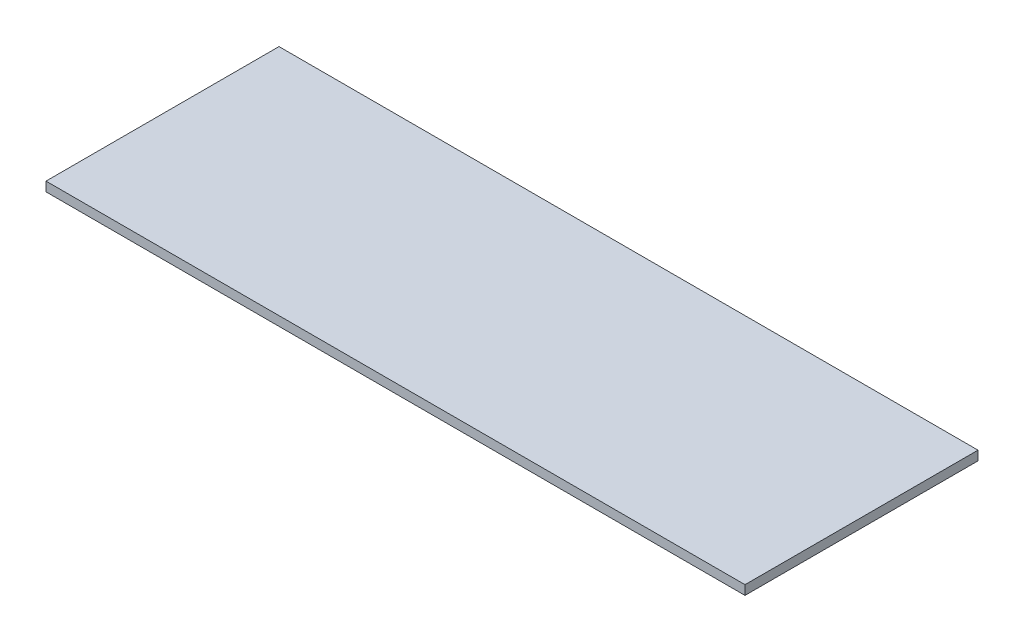
ISO-10303-21;
HEADER;
FILE_DESCRIPTION(('STEP AP214'),'2;1');
FILE_NAME('part.step','',(''),(''),'','','');
FILE_SCHEMA(('AUTOMOTIVE_DESIGN { 1 0 10303 214 1 1 1 1 }'));
ENDSEC;
DATA;
#1=APPLICATION_CONTEXT('core data for automotive mechanical design processes');
#2=APPLICATION_PROTOCOL_DEFINITION('international standard','automotive_design',2000,#1);
#3=PRODUCT_CONTEXT('',#1,'mechanical');
#4=PRODUCT('Part','Part','',(#3));
#5=PRODUCT_RELATED_PRODUCT_CATEGORY('part','',(#4));
#6=PRODUCT_DEFINITION_FORMATION('','',#4);
#7=PRODUCT_DEFINITION_CONTEXT('part definition',#1,'design');
#8=PRODUCT_DEFINITION('design','',#6,#7);
#9=PRODUCT_DEFINITION_SHAPE('','',#8);
#10=(LENGTH_UNIT() NAMED_UNIT(*) SI_UNIT(.MILLI.,.METRE.));
#11=(NAMED_UNIT(*) PLANE_ANGLE_UNIT() SI_UNIT($,.RADIAN.));
#12=(NAMED_UNIT(*) SI_UNIT($,.STERADIAN.) SOLID_ANGLE_UNIT());
#13=UNCERTAINTY_MEASURE_WITH_UNIT(LENGTH_MEASURE(1.E-05),#10,'distance_accuracy_value','');
#14=(GEOMETRIC_REPRESENTATION_CONTEXT(3) GLOBAL_UNCERTAINTY_ASSIGNED_CONTEXT((#13)) GLOBAL_UNIT_ASSIGNED_CONTEXT((#10,
#11,#12)) REPRESENTATION_CONTEXT('',''));
#15=CARTESIAN_POINT('',(0.,0.,0.));
#16=DIRECTION('',(0.,0.,1.));
#17=DIRECTION('',(1.,0.,0.));
#18=AXIS2_PLACEMENT_3D('',#15,#16,#17);
#19=CARTESIAN_POINT('',(0.,1.,0.));
#20=DIRECTION('',(1.,0.,0.));
#21=DIRECTION('',(0.,0.,-1.));
#22=AXIS2_PLACEMENT_3D('',#19,#20,#21);
#23=PLANE('',#22);
#24=DIRECTION('',(0.,0.,1.));
#25=VECTOR('',#24,1.);
#26=CARTESIAN_POINT('',(0.,0.,0.));
#27=LINE('',#26,#25);
#28=CARTESIAN_POINT('',(0.,0.,-25.));
#29=VERTEX_POINT('',#28);
#30=CARTESIAN_POINT('',(0.,0.,0.));
#31=VERTEX_POINT('',#30);
#32=EDGE_CURVE('E96',#29,#31,#27,.T.);
#33=ORIENTED_EDGE('',*,*,#32,.T.);
#34=DIRECTION('',(0.,-1.,0.));
#35=VECTOR('',#34,1.);
#36=CARTESIAN_POINT('',(0.,1.,0.));
#37=LINE('',#36,#35);
#38=CARTESIAN_POINT('',(0.,1.,0.));
#39=VERTEX_POINT('',#38);
#40=EDGE_CURVE('E11',#39,#31,#37,.T.);
#41=ORIENTED_EDGE('',*,*,#40,.F.);
#42=DIRECTION('',(0.,0.,1.));
#43=VECTOR('',#42,1.);
#44=CARTESIAN_POINT('',(0.,1.,0.));
#45=LINE('',#44,#43);
#46=CARTESIAN_POINT('',(0.,1.,-25.));
#47=VERTEX_POINT('',#46);
#48=EDGE_CURVE('E84',#47,#39,#45,.T.);
#49=ORIENTED_EDGE('',*,*,#48,.F.);
#50=DIRECTION('',(0.,-1.,0.));
#51=VECTOR('',#50,1.);
#52=CARTESIAN_POINT('',(0.,1.,-25.));
#53=LINE('',#52,#51);
#54=EDGE_CURVE('E92',#47,#29,#53,.T.);
#55=ORIENTED_EDGE('',*,*,#54,.T.);
#56=EDGE_LOOP('',(#33,#41,#49,#55));
#57=FACE_BOUND('',#56,.T.);
#58=ADVANCED_FACE('F33',(#57),#23,.F.);
#59=CARTESIAN_POINT('',(0.,1.,0.));
#60=DIRECTION('',(0.,0.,-1.));
#61=DIRECTION('',(-1.,0.,0.));
#62=AXIS2_PLACEMENT_3D('',#59,#60,#61);
#63=PLANE('',#62);
#64=DIRECTION('',(1.,0.,0.));
#65=VECTOR('',#64,1.);
#66=CARTESIAN_POINT('',(0.,0.,0.));
#67=LINE('',#66,#65);
#68=CARTESIAN_POINT('',(75.,0.,0.));
#69=VERTEX_POINT('',#68);
#70=EDGE_CURVE('E88',#31,#69,#67,.T.);
#71=ORIENTED_EDGE('',*,*,#70,.T.);
#72=DIRECTION('',(0.,-1.,0.));
#73=VECTOR('',#72,1.);
#74=CARTESIAN_POINT('',(75.,1.,0.));
#75=LINE('',#74,#73);
#76=CARTESIAN_POINT('',(75.,1.,0.));
#77=VERTEX_POINT('',#76);
#78=EDGE_CURVE('E41',#77,#69,#75,.T.);
#79=ORIENTED_EDGE('',*,*,#78,.F.);
#80=DIRECTION('',(1.,0.,0.));
#81=VECTOR('',#80,1.);
#82=CARTESIAN_POINT('',(0.,1.,0.));
#83=LINE('',#82,#81);
#84=EDGE_CURVE('E79',#39,#77,#83,.T.);
#85=ORIENTED_EDGE('',*,*,#84,.F.);
#86=ORIENTED_EDGE('',*,*,#40,.T.);
#87=EDGE_LOOP('',(#71,#79,#85,#86));
#88=FACE_BOUND('',#87,.T.);
#89=ADVANCED_FACE('F87',(#88),#63,.F.);
#90=CARTESIAN_POINT('',(75.,1.,0.));
#91=DIRECTION('',(-1.,0.,0.));
#92=DIRECTION('',(0.,0.,1.));
#93=AXIS2_PLACEMENT_3D('',#90,#91,#92);
#94=PLANE('',#93);
#95=DIRECTION('',(0.,0.,-1.));
#96=VECTOR('',#95,1.);
#97=CARTESIAN_POINT('',(75.,0.,0.));
#98=LINE('',#97,#96);
#99=CARTESIAN_POINT('',(75.,0.,-25.));
#100=VERTEX_POINT('',#99);
#101=EDGE_CURVE('E66',#69,#100,#98,.T.);
#102=ORIENTED_EDGE('',*,*,#101,.T.);
#103=DIRECTION('',(0.,-1.,0.));
#104=VECTOR('',#103,1.);
#105=CARTESIAN_POINT('',(75.,1.,-25.));
#106=LINE('',#105,#104);
#107=CARTESIAN_POINT('',(75.,1.,-25.));
#108=VERTEX_POINT('',#107);
#109=EDGE_CURVE('E89',#108,#100,#106,.T.);
#110=ORIENTED_EDGE('',*,*,#109,.F.);
#111=DIRECTION('',(0.,0.,-1.));
#112=VECTOR('',#111,1.);
#113=CARTESIAN_POINT('',(75.,1.,0.));
#114=LINE('',#113,#112);
#115=EDGE_CURVE('E82',#77,#108,#114,.T.);
#116=ORIENTED_EDGE('',*,*,#115,.F.);
#117=ORIENTED_EDGE('',*,*,#78,.T.);
#118=EDGE_LOOP('',(#102,#110,#116,#117));
#119=FACE_BOUND('',#118,.T.);
#120=ADVANCED_FACE('F90',(#119),#94,.F.);
#121=CARTESIAN_POINT('',(0.,1.,-25.));
#122=DIRECTION('',(0.,0.,1.));
#123=DIRECTION('',(1.,0.,0.));
#124=AXIS2_PLACEMENT_3D('',#121,#122,#123);
#125=PLANE('',#124);
#126=DIRECTION('',(-1.,0.,0.));
#127=VECTOR('',#126,1.);
#128=CARTESIAN_POINT('',(0.,0.,-25.));
#129=LINE('',#128,#127);
#130=EDGE_CURVE('E72',#100,#29,#129,.T.);
#131=ORIENTED_EDGE('',*,*,#130,.T.);
#132=ORIENTED_EDGE('',*,*,#54,.F.);
#133=DIRECTION('',(-1.,0.,0.));
#134=VECTOR('',#133,1.);
#135=CARTESIAN_POINT('',(0.,1.,-25.));
#136=LINE('',#135,#134);
#137=EDGE_CURVE('E49',#108,#47,#136,.T.);
#138=ORIENTED_EDGE('',*,*,#137,.F.);
#139=ORIENTED_EDGE('',*,*,#109,.T.);
#140=EDGE_LOOP('',(#131,#132,#138,#139));
#141=FACE_BOUND('',#140,.T.);
#142=ADVANCED_FACE('F103',(#141),#125,.F.);
#143=CARTESIAN_POINT('',(0.,1.,0.));
#144=DIRECTION('',(0.,-1.,0.));
#145=DIRECTION('',(0.,0.,-1.));
#146=AXIS2_PLACEMENT_3D('',#143,#144,#145);
#147=PLANE('',#146);
#148=ORIENTED_EDGE('',*,*,#48,.T.);
#149=ORIENTED_EDGE('',*,*,#84,.T.);
#150=ORIENTED_EDGE('',*,*,#115,.T.);
#151=ORIENTED_EDGE('',*,*,#137,.T.);
#152=EDGE_LOOP('',(#148,#149,#150,#151));
#153=FACE_BOUND('',#152,.T.);
#154=ADVANCED_FACE('F80',(#153),#147,.F.);
#155=CARTESIAN_POINT('',(0.,0.,0.));
#156=DIRECTION('',(0.,-1.,0.));
#157=DIRECTION('',(0.,0.,-1.));
#158=AXIS2_PLACEMENT_3D('',#155,#156,#157);
#159=PLANE('',#158);
#160=ORIENTED_EDGE('',*,*,#32,.F.);
#161=ORIENTED_EDGE('',*,*,#130,.F.);
#162=ORIENTED_EDGE('',*,*,#101,.F.);
#163=ORIENTED_EDGE('',*,*,#70,.F.);
#164=EDGE_LOOP('',(#160,#161,#162,#163));
#165=FACE_BOUND('',#164,.T.);
#166=ADVANCED_FACE('F106',(#165),#159,.T.);
#167=CLOSED_SHELL('',(#58,#89,#120,#142,#154,#166));
#168=MANIFOLD_SOLID_BREP('B2',#167);
#169=ADVANCED_BREP_SHAPE_REPRESENTATION('',(#18,#168),#14);
#170=SHAPE_DEFINITION_REPRESENTATION(#9,#169);
ENDSEC;
END-ISO-10303-21;
